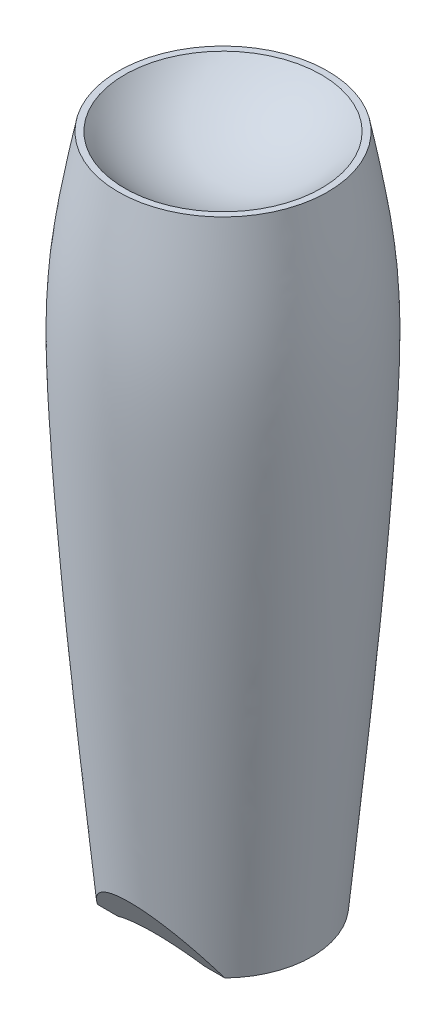
ISO-10303-21;
HEADER;
FILE_DESCRIPTION(('STEP AP214'),'2;1');
FILE_NAME('part.step','',(''),(''),'','','');
FILE_SCHEMA(('AUTOMOTIVE_DESIGN { 1 0 10303 214 1 1 1 1 }'));
ENDSEC;
DATA;
#1=APPLICATION_CONTEXT('core data for automotive mechanical design processes');
#2=APPLICATION_PROTOCOL_DEFINITION('international standard','automotive_design',2000,#1);
#3=PRODUCT_CONTEXT('',#1,'mechanical');
#4=PRODUCT('Part','Part','',(#3));
#5=PRODUCT_RELATED_PRODUCT_CATEGORY('part','',(#4));
#6=PRODUCT_DEFINITION_FORMATION('','',#4);
#7=PRODUCT_DEFINITION_CONTEXT('part definition',#1,'design');
#8=PRODUCT_DEFINITION('design','',#6,#7);
#9=PRODUCT_DEFINITION_SHAPE('','',#8);
#10=(LENGTH_UNIT() NAMED_UNIT(*) SI_UNIT(.MILLI.,.METRE.));
#11=(NAMED_UNIT(*) PLANE_ANGLE_UNIT() SI_UNIT($,.RADIAN.));
#12=(NAMED_UNIT(*) SI_UNIT($,.STERADIAN.) SOLID_ANGLE_UNIT());
#13=UNCERTAINTY_MEASURE_WITH_UNIT(LENGTH_MEASURE(1.E-05),#10,'distance_accuracy_value','');
#14=(GEOMETRIC_REPRESENTATION_CONTEXT(3) GLOBAL_UNCERTAINTY_ASSIGNED_CONTEXT((#13)) GLOBAL_UNIT_ASSIGNED_CONTEXT((#10,
#11,#12)) REPRESENTATION_CONTEXT('',''));
#15=CARTESIAN_POINT('',(0.,0.,0.));
#16=DIRECTION('',(0.,0.,1.));
#17=DIRECTION('',(1.,0.,0.));
#18=AXIS2_PLACEMENT_3D('',#15,#16,#17);
#19=CARTESIAN_POINT('',(-2.78956281185619E-06,-126.576695118875,0.0406559169198866));
#20=DIRECTION('',(0.,1.,0.));
#21=DIRECTION('',(0.,0.,1.));
#22=AXIS2_PLACEMENT_3D('',#19,#20,#21);
#23=PLANE('',#22);
#24=CARTESIAN_POINT('',(-2.78956284976423E-06,-126.576695118875,0.0406559169198866));
#25=DIRECTION('',(0.,1.,0.));
#26=DIRECTION('',(0.,0.,1.));
#27=AXIS2_PLACEMENT_3D('',#24,#25,#26);
#28=CIRCLE('',#27,31.57728);
#29=CARTESIAN_POINT('',(22.6606780664045,-126.576695118875,22.0319759169198));
#30=VERTEX_POINT('',#29);
#31=CARTESIAN_POINT('',(-22.6606836455302,-126.576695118875,22.0319759169198));
#32=VERTEX_POINT('',#31);
#33=EDGE_CURVE('E44',#30,#32,#28,.T.);
#34=ORIENTED_EDGE('',*,*,#33,.F.);
#35=DIRECTION('',(1.,0.,0.));
#36=VECTOR('',#35,1.);
#37=CARTESIAN_POINT('',(-42.2910027895629,-126.576695118875,22.0319759169198));
#38=LINE('',#37,#36);
#39=CARTESIAN_POINT('',(15.4193058631492,-126.576695118875,22.0319759169198));
#40=VERTEX_POINT('',#39);
#41=EDGE_CURVE('E63',#40,#30,#38,.T.);
#42=ORIENTED_EDGE('',*,*,#41,.F.);
#43=CARTESIAN_POINT('',(-2.78956284976423E-06,-126.576695118875,0.0406559169198722));
#44=DIRECTION('',(0.,1.,0.));
#45=DIRECTION('',(0.,0.,1.));
#46=AXIS2_PLACEMENT_3D('',#43,#44,#45);
#47=CIRCLE('',#46,26.8583922577283);
#48=CARTESIAN_POINT('',(-15.4193114422749,-126.576695118875,22.0319759169198));
#49=VERTEX_POINT('',#48);
#50=EDGE_CURVE('E65',#49,#40,#47,.F.);
#51=ORIENTED_EDGE('',*,*,#50,.F.);
#52=EDGE_CURVE('E50',#32,#49,#38,.T.);
#53=ORIENTED_EDGE('',*,*,#52,.F.);
#54=EDGE_LOOP('',(#34,#42,#51,#53));
#55=FACE_BOUND('',#54,.T.);
#56=ADVANCED_FACE('F36',(#55),#23,.F.);
#57=CARTESIAN_POINT('',(-2.78956288479353E-06,111.662604881125,0.0406559169198866));
#58=DIRECTION('',(0.,-1.,0.));
#59=DIRECTION('',(0.,0.,-1.));
#60=AXIS2_PLACEMENT_3D('',#57,#58,#59);
#61=PLANE('',#60);
#62=CARTESIAN_POINT('',(-2.78956284976423E-06,111.662604881125,0.0406559169198866));
#63=DIRECTION('',(0.,1.,0.));
#64=DIRECTION('',(0.,0.,1.));
#65=AXIS2_PLACEMENT_3D('',#62,#63,#64);
#66=CIRCLE('',#65,37.21608);
#67=CARTESIAN_POINT('',(-2.78956284976423E-06,111.662604881125,37.2567359169199));
#68=VERTEX_POINT('',#67);
#69=EDGE_CURVE('E72',#68,#68,#66,.T.);
#70=ORIENTED_EDGE('',*,*,#69,.T.);
#71=EDGE_LOOP('',(#70));
#72=FACE_BOUND('',#71,.T.);
#73=CARTESIAN_POINT('',(-2.78956284976423E-06,111.662604881125,0.0406559169198866));
#74=DIRECTION('',(0.,-1.,0.));
#75=DIRECTION('',(0.,0.,-1.));
#76=AXIS2_PLACEMENT_3D('',#73,#74,#75);
#77=CIRCLE('',#76,34.9665279785183);
#78=CARTESIAN_POINT('',(-2.78956284976423E-06,111.662604881125,-34.9258720615984));
#79=VERTEX_POINT('',#78);
#80=EDGE_CURVE('E75',#79,#79,#77,.F.);
#81=ORIENTED_EDGE('',*,*,#80,.F.);
#82=EDGE_LOOP('',(#81));
#83=FACE_BOUND('',#82,.T.);
#84=ADVANCED_FACE('F38',(#72,#83),#61,.F.);
#85=CARTESIAN_POINT('',(31.5772772104372,-126.576695118875,0.0406559169198866));
#86=CARTESIAN_POINT('',(33.4997059070299,-106.32647250304,0.0406559169198866));
#87=CARTESIAN_POINT('',(38.2571827550114,-56.2127983615467,0.0406559169198866));
#88=CARTESIAN_POINT('',(43.4414830665297,9.18652831131098,0.0406559169198866));
#89=CARTESIAN_POINT('',(45.4516877924408,68.8588122416347,0.0406559169198866));
#90=CARTESIAN_POINT('',(39.876215596065,97.8367918807416,0.0406559169198866));
#91=CARTESIAN_POINT('',(37.2160772104372,111.662604881125,0.0406559169198866));
#92=B_SPLINE_CURVE_WITH_KNOTS('',3,(#85,#86,#87,#88,#89,#90,#91),.UNSPECIFIED.,.F.,.F.,(4,1,1,1,
4),(0.,0.255009842354455,0.631078501459618,0.823982219803997,1.),.UNSPECIFIED.);
#93=CARTESIAN_POINT('',(-2.78956284976423E-06,182.976112775862,0.0406559169198866));
#94=DIRECTION('',(0.,1.,0.));
#95=AXIS1_PLACEMENT('',#93,#94);
#96=SURFACE_OF_REVOLUTION('',#92,#95);
#97=ORIENTED_EDGE('',*,*,#69,.F.);
#98=EDGE_LOOP('',(#97));
#99=FACE_BOUND('',#98,.T.);
#100=ORIENTED_EDGE('',*,*,#33,.T.);
#101=CARTESIAN_POINT('',(-22.6606836455302,-126.576695118875,22.0319759169198));
#102=CARTESIAN_POINT('',(-22.4088341111141,-126.060262039044,22.3618508007644));
#103=CARTESIAN_POINT('',(-22.147406155159,-125.547095769314,22.6896389890719));
#104=CARTESIAN_POINT('',(-21.603006106863,-124.52598942808,23.3418770986397));
#105=CARTESIAN_POINT('',(-21.3199365987568,-124.018086280193,23.6663034347067));
#106=CARTESIAN_POINT('',(-20.7314646338922,-123.009811729816,24.3103451570106));
#107=CARTESIAN_POINT('',(-20.426003567648,-122.509464550614,24.6299450704688));
#108=CARTESIAN_POINT('',(-19.7918563613254,-121.518687867319,25.262809919918));
#109=CARTESIAN_POINT('',(-19.4631481007598,-121.028268396228,25.5760684472649));
#110=CARTESIAN_POINT('',(-18.7752676486129,-120.050900139795,26.2003685795679));
#111=CARTESIAN_POINT('',(-18.4156554550546,-119.564170636429,26.5112701167797));
#112=CARTESIAN_POINT('',(-17.6700023477334,-118.606057898865,27.1232706650736));
#113=CARTESIAN_POINT('',(-17.2839923117624,-118.134657655368,27.4243805409529));
#114=CARTESIAN_POINT('',(-16.4840092871083,-117.209967263289,28.0150323554704));
#115=CARTESIAN_POINT('',(-16.0700755631668,-116.756653054823,28.3045896625112));
#116=CARTESIAN_POINT('',(-15.2122773968657,-115.871066205357,28.8702638427889));
#117=CARTESIAN_POINT('',(-14.7684374306022,-115.438776844232,29.1463913961108));
#118=CARTESIAN_POINT('',(-14.0518586743916,-114.784389807917,29.5643852389223));
#119=CARTESIAN_POINT('',(-13.7900689142114,-114.553736610084,29.7117164224099));
#120=CARTESIAN_POINT('',(-13.2562212524081,-114.100982259034,30.0009161169984));
#121=CARTESIAN_POINT('',(-12.9841629036947,-113.87888147904,30.1427843897017));
#122=CARTESIAN_POINT('',(-12.4295366852734,-113.444168366974,30.4204601292091));
#123=CARTESIAN_POINT('',(-12.1469683485155,-113.231556457503,30.5562673260755));
#124=CARTESIAN_POINT('',(-11.5718674112039,-112.8173915052,30.8208177990582));
#125=CARTESIAN_POINT('',(-11.2793620182522,-112.615811678594,30.94957818348));
#126=CARTESIAN_POINT('',(-10.6835783462204,-112.224258615418,31.1996851698029));
#127=CARTESIAN_POINT('',(-10.3803000049006,-112.034285445922,31.3210317288604));
#128=CARTESIAN_POINT('',(-9.7629603978405,-111.667190556724,31.5555159024416));
#129=CARTESIAN_POINT('',(-9.44889854475439,-111.490069538681,31.6686530687758));
#130=CARTESIAN_POINT('',(-8.64354233968273,-111.061357744126,31.9424954289088));
#131=CARTESIAN_POINT('',(-8.14519271832899,-110.819070783329,32.0972577517948));
#132=CARTESIAN_POINT('',(-7.12497108330315,-110.372454118046,32.3825369609254));
#133=CARTESIAN_POINT('',(-6.60310298892828,-110.168118117977,32.5130578685135));
#134=CARTESIAN_POINT('',(-5.80505940957742,-109.894158106312,32.6880515522168));
#135=CARTESIAN_POINT('',(-5.53662799670551,-109.808293212411,32.7428982942403));
#136=CARTESIAN_POINT('',(-4.9950401586363,-109.647971073814,32.8453050704773));
#137=CARTESIAN_POINT('',(-4.72188466606784,-109.573511605431,32.8928665250843));
#138=CARTESIAN_POINT('',(-4.17137872295113,-109.436587269354,32.9803278075285));
#139=CARTESIAN_POINT('',(-3.89402841995709,-109.374121980814,33.0202279041841));
#140=CARTESIAN_POINT('',(-3.33579709348896,-109.261718613685,33.0920262632041));
#141=CARTESIAN_POINT('',(-3.0549163488831,-109.211779552103,33.1239251534611));
#142=CARTESIAN_POINT('',(-2.43744078759701,-109.116736847262,33.1846342800532));
#143=CARTESIAN_POINT('',(-2.10026381751102,-109.074290535104,33.211747129403));
#144=CARTESIAN_POINT('',(-1.42332646868634,-109.008267219352,33.2539199383598));
#145=CARTESIAN_POINT('',(-1.08356614981205,-108.984689779844,33.2689801764099));
#146=CARTESIAN_POINT('',(-0.402950314893106,-108.956729633157,33.2868398962858));
#147=CARTESIAN_POINT('',(-0.06209486743407,-108.952345746505,33.2896401315083));
#148=CARTESIAN_POINT('',(0.619181780167271,-108.962831657675,33.2829421896754));
#149=CARTESIAN_POINT('',(0.959602997941436,-108.9777006471,33.273444528989));
#150=CARTESIAN_POINT('',(1.63853337713018,-109.026484021355,33.2422838412942));
#151=CARTESIAN_POINT('',(1.9770424378446,-109.060399399955,33.2206201795092));
#152=CARTESIAN_POINT('',(2.65063459359388,-109.146800716606,33.1654307940741));
#153=CARTESIAN_POINT('',(2.98571818114617,-109.19928394519,33.1319068011134));
#154=CARTESIAN_POINT('',(3.74171886922413,-109.338852480201,33.0427565199378));
#155=CARTESIAN_POINT('',(4.16120794800995,-109.431465621314,32.9835992924866));
#156=CARTESIAN_POINT('',(4.99044967876039,-109.643862584132,32.8479293941492));
#157=CARTESIAN_POINT('',(5.40020035641006,-109.76365186435,32.7714132366044));
#158=CARTESIAN_POINT('',(6.0060494622422,-109.962079584925,32.6446662797721));
#159=CARTESIAN_POINT('',(6.20654490789087,-110.031349558793,32.6004196474863));
#160=CARTESIAN_POINT('',(6.60442715086659,-110.17584963198,32.5081193152267));
#161=CARTESIAN_POINT('',(6.80181478544777,-110.251078091952,32.4600666623973));
#162=CARTESIAN_POINT('',(7.3892597175398,-110.485343521386,32.3104281432137));
#163=CARTESIAN_POINT('',(7.77453805018644,-110.652940425701,32.2033745645352));
#164=CARTESIAN_POINT('',(8.73498426457539,-111.104369212899,31.9150215822096));
#165=CARTESIAN_POINT('',(9.30088063641373,-111.402249671512,31.724748562293));
#166=CARTESIAN_POINT('',(10.3992310147855,-112.039018556815,31.3180084244539));
#167=CARTESIAN_POINT('',(10.9316691583397,-112.377926215498,31.1015290219754));
#168=CARTESIAN_POINT('',(11.9644576173824,-113.090847767599,30.6461458883728));
#169=CARTESIAN_POINT('',(12.4647221818499,-113.464949423857,30.4071860981816));
#170=CARTESIAN_POINT('',(13.4326928472496,-114.241760159402,29.9109933460815));
#171=CARTESIAN_POINT('',(13.9004003611793,-114.644467995627,29.6537611781859));
#172=CARTESIAN_POINT('',(14.8475845838432,-115.512999061956,29.0989814868572));
#173=CARTESIAN_POINT('',(15.3239943619413,-115.981190012088,28.7999215673373));
#174=CARTESIAN_POINT('',(16.2421558431798,-116.94143999621,28.186555839337));
#175=CARTESIAN_POINT('',(16.6838872211984,-117.433512758037,27.872241262115));
#176=CARTESIAN_POINT('',(17.5347684067609,-118.437415143439,27.2309922877388));
#177=CARTESIAN_POINT('',(17.9439087004717,-118.94925047174,26.9040542466552));
#178=CARTESIAN_POINT('',(18.7318003457707,-119.989586459142,26.2395330794289));
#179=CARTESIAN_POINT('',(19.1105358686376,-120.518095601748,25.9019445343946));
#180=CARTESIAN_POINT('',(19.8392098196613,-121.588721426133,25.218075542936));
#181=CARTESIAN_POINT('',(20.1891589473361,-122.13083295342,24.8717983889765));
#182=CARTESIAN_POINT('',(20.8621002020563,-123.226598151412,24.1718714642204));
#183=CARTESIAN_POINT('',(21.1850998437471,-123.780248550418,23.8182237832425));
#184=CARTESIAN_POINT('',(21.7007009753372,-124.708286106358,23.2254339467184));
#185=CARTESIAN_POINT('',(21.9004183293167,-125.079884606509,22.9880730632631));
#186=CARTESIAN_POINT('',(22.2886598355484,-125.82597424167,22.5115036076101));
#187=CARTESIAN_POINT('',(22.4772137406252,-126.200454375004,22.2723020628022));
#188=CARTESIAN_POINT('',(22.6606780664045,-126.576695118875,22.0319759169199));
#189=B_SPLINE_CURVE_WITH_KNOTS('',3,(#101,#102,#103,#104,#105,#106,#107,#108,#109,#110,#111,
#112,#113,#114,#115,#116,#117,#118,#119,#120,#121,#122,#123,#124,#125,#126,#127,#128,#129,#130,
#131,#132,#133,#134,#135,#136,#137,#138,#139,#140,#141,#142,#143,#144,#145,#146,#147,#148,#149,
#150,#151,#152,#153,#154,#155,#156,#157,#158,#159,#160,#161,#162,#163,#164,#165,#166,#167,#168,
#169,#170,#171,#172,#173,#174,#175,#176,#177,#178,#179,#180,#181,#182,#183,#184,#185,#186,#187,
#188),.UNSPECIFIED.,.F.,.F.,(4,2,2,2,2,2,2,2,2,2,2,2,2,2,2,2,2,2,2,2,2,2,2,2,2,2,2,2,2,2,2,2,2,
2,2,2,2,2,2,2,2,2,2,4),(0.,1.98759834360023,3.98474000069398,5.98730986134781,7.99181155997154,
10.0321958788657,12.0702330688417,14.1054619275071,16.1390448690963,17.2750228124919,
18.4110502731014,19.5471282777302,20.6803131357827,21.8135045417514,22.9467577674909,
24.6706896130754,26.3943352242889,27.2553888158118,28.116274315698,28.9771296036827,
29.8379173151155,30.8599207126915,31.8819004989398,32.9038174820227,33.925691557837,
34.9476189561816,35.9693972937705,37.2689288216144,38.568721600608,39.2186747474683,
39.8684496907979,41.1681956145076,43.1667161814276,45.1661772330753,47.1707636125019,
49.17526293724,51.3692495514526,53.5645126141963,55.7604141769415,57.957451610855,
60.15366871036,62.3492713515282,63.8013173456625,65.249300832995),.UNSPECIFIED.);
#190=EDGE_CURVE('E56',#32,#30,#189,.T.);
#191=ORIENTED_EDGE('',*,*,#190,.T.);
#192=EDGE_LOOP('',(#100,#191));
#193=FACE_BOUND('',#192,.T.);
#194=ADVANCED_FACE('F71',(#99,#193),#96,.T.);
#195=CARTESIAN_POINT('',(-2.78956284976423E-06,141.266304881125,0.0406559169198866));
#196=DIRECTION('',(0.,1.,0.));
#197=DIRECTION('',(0.,0.,-1.));
#198=AXIS2_PLACEMENT_3D('',#195,#196,#197);
#199=SPHERICAL_SURFACE('',#198,45.81525);
#200=ORIENTED_EDGE('',*,*,#80,.T.);
#201=EDGE_LOOP('',(#200));
#202=FACE_BOUND('',#201,.T.);
#203=ADVANCED_FACE('F96',(#202),#199,.F.);
#204=CARTESIAN_POINT('',(-2.78956284976423E-06,-142.083395118875,0.0406559169198722));
#205=DIRECTION('',(0.,1.,0.));
#206=DIRECTION('',(0.,0.,1.));
#207=AXIS2_PLACEMENT_3D('',#204,#205,#206);
#208=SPHERICAL_SURFACE('',#207,31.0134);
#209=CARTESIAN_POINT('',(-2.78956284976423E-06,-147.566462492253,8.62462974831416));
#210=DIRECTION('',(0.,0.538309925467669,-0.842746951429071));
#211=DIRECTION('',(0.,0.842746951429071,0.538309925467669));
#212=AXIS2_PLACEMENT_3D('',#209,#210,#211);
#213=CIRCLE('',#212,29.2930426040201);
#214=EDGE_CURVE('E11',#49,#40,#213,.T.);
#215=ORIENTED_EDGE('',*,*,#214,.F.);
#216=ORIENTED_EDGE('',*,*,#50,.T.);
#217=EDGE_LOOP('',(#215,#216));
#218=FACE_BOUND('',#217,.T.);
#219=ADVANCED_FACE('F81',(#218),#208,.F.);
#220=CARTESIAN_POINT('',(-42.2910027895629,-108.955445118874,33.2876603878778));
#221=DIRECTION('',(0.,0.538309925467669,-0.842746951429071));
#222=DIRECTION('',(0.,0.842746951429071,0.538309925467669));
#223=AXIS2_PLACEMENT_3D('',#220,#221,#222);
#224=PLANE('',#223);
#225=ORIENTED_EDGE('',*,*,#52,.T.);
#226=ORIENTED_EDGE('',*,*,#214,.T.);
#227=ORIENTED_EDGE('',*,*,#41,.T.);
#228=ORIENTED_EDGE('',*,*,#190,.F.);
#229=EDGE_LOOP('',(#225,#226,#227,#228));
#230=FACE_BOUND('',#229,.T.);
#231=ADVANCED_FACE('F61',(#230),#224,.F.);
#232=CLOSED_SHELL('',(#56,#84,#194,#203,#219,#231));
#233=MANIFOLD_SOLID_BREP('B2',#232);
#234=ADVANCED_BREP_SHAPE_REPRESENTATION('',(#18,#233),#14);
#235=SHAPE_DEFINITION_REPRESENTATION(#9,#234);
ENDSEC;
END-ISO-10303-21;
